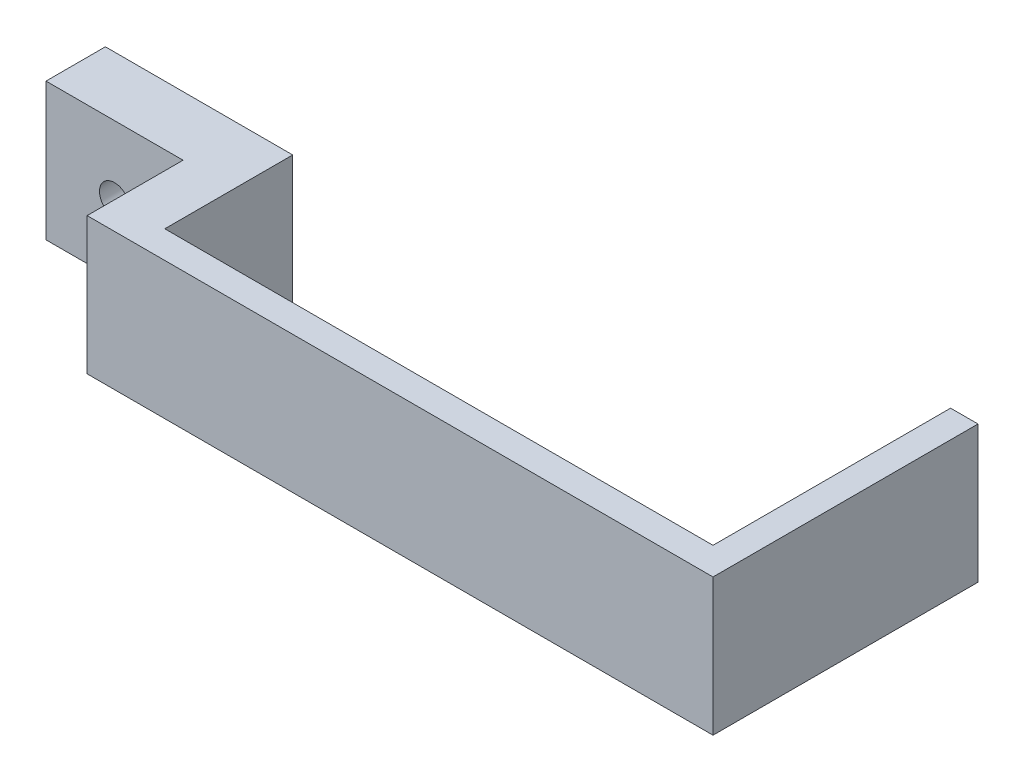
ISO-10303-21;
HEADER;
FILE_DESCRIPTION(('STEP AP214'),'2;1');
FILE_NAME('part.step','',(''),(''),'','','');
FILE_SCHEMA(('AUTOMOTIVE_DESIGN { 1 0 10303 214 1 1 1 1 }'));
ENDSEC;
DATA;
#1=APPLICATION_CONTEXT('core data for automotive mechanical design processes');
#2=APPLICATION_PROTOCOL_DEFINITION('international standard','automotive_design',2000,#1);
#3=PRODUCT_CONTEXT('',#1,'mechanical');
#4=PRODUCT('Part','Part','',(#3));
#5=PRODUCT_RELATED_PRODUCT_CATEGORY('part','',(#4));
#6=PRODUCT_DEFINITION_FORMATION('','',#4);
#7=PRODUCT_DEFINITION_CONTEXT('part definition',#1,'design');
#8=PRODUCT_DEFINITION('design','',#6,#7);
#9=PRODUCT_DEFINITION_SHAPE('','',#8);
#10=(LENGTH_UNIT() NAMED_UNIT(*) SI_UNIT(.MILLI.,.METRE.));
#11=(NAMED_UNIT(*) PLANE_ANGLE_UNIT() SI_UNIT($,.RADIAN.));
#12=(NAMED_UNIT(*) SI_UNIT($,.STERADIAN.) SOLID_ANGLE_UNIT());
#13=UNCERTAINTY_MEASURE_WITH_UNIT(LENGTH_MEASURE(1.E-05),#10,'distance_accuracy_value','');
#14=(GEOMETRIC_REPRESENTATION_CONTEXT(3) GLOBAL_UNCERTAINTY_ASSIGNED_CONTEXT((#13)) GLOBAL_UNIT_ASSIGNED_CONTEXT((#10,
#11,#12)) REPRESENTATION_CONTEXT('',''));
#15=CARTESIAN_POINT('',(0.,0.,0.));
#16=DIRECTION('',(0.,0.,1.));
#17=DIRECTION('',(1.,0.,0.));
#18=AXIS2_PLACEMENT_3D('',#15,#16,#17);
#19=CARTESIAN_POINT('',(0.,0.,0.));
#20=DIRECTION('',(0.,0.,-1.));
#21=DIRECTION('',(-1.,0.,0.));
#22=AXIS2_PLACEMENT_3D('',#19,#20,#21);
#23=PLANE('',#22);
#24=DIRECTION('',(-1.,0.,0.));
#25=VECTOR('',#24,1.);
#26=CARTESIAN_POINT('',(59.4999999999999,-52.5000000000001,0.));
#27=LINE('',#26,#25);
#28=CARTESIAN_POINT('',(60.4999999999999,-52.5000000000001,0.));
#29=VERTEX_POINT('',#28);
#30=CARTESIAN_POINT('',(-59.4999999999986,-52.5000000000001,0.));
#31=VERTEX_POINT('',#30);
#32=EDGE_CURVE('E197',#29,#31,#27,.T.);
#33=ORIENTED_EDGE('',*,*,#32,.F.);
#34=DIRECTION('',(0.,1.,0.));
#35=VECTOR('',#34,1.);
#36=CARTESIAN_POINT('',(60.4999999999999,-52.5000000000001,0.));
#37=LINE('',#36,#35);
#38=CARTESIAN_POINT('',(60.4999999999999,-82.5000000000001,0.));
#39=VERTEX_POINT('',#38);
#40=EDGE_CURVE('E139',#39,#29,#37,.T.);
#41=ORIENTED_EDGE('',*,*,#40,.F.);
#42=DIRECTION('',(1.,0.,0.));
#43=VECTOR('',#42,1.);
#44=CARTESIAN_POINT('',(59.4999999999999,-82.5000000000001,0.));
#45=LINE('',#44,#43);
#46=CARTESIAN_POINT('',(-59.4999999999986,-82.5000000000001,0.));
#47=VERTEX_POINT('',#46);
#48=EDGE_CURVE('E209',#47,#39,#45,.T.);
#49=ORIENTED_EDGE('',*,*,#48,.F.);
#50=DIRECTION('',(0.,-1.,0.));
#51=VECTOR('',#50,1.);
#52=CARTESIAN_POINT('',(-59.4999999999986,-52.5000000000001,0.));
#53=LINE('',#52,#51);
#54=EDGE_CURVE('E185',#31,#47,#53,.T.);
#55=ORIENTED_EDGE('',*,*,#54,.F.);
#56=EDGE_LOOP('',(#33,#41,#49,#55));
#57=FACE_BOUND('',#56,.T.);
#58=ADVANCED_FACE('F33',(#57),#23,.T.);
#59=CARTESIAN_POINT('',(-70.5000000000002,-82.5000000000001,6.));
#60=DIRECTION('',(1.,0.,0.));
#61=DIRECTION('',(0.,0.,-1.));
#62=AXIS2_PLACEMENT_3D('',#59,#60,#61);
#63=PLANE('',#62);
#64=DIRECTION('',(0.,1.,0.));
#65=VECTOR('',#64,1.);
#66=CARTESIAN_POINT('',(-70.5000000000002,-52.5000000000001,-14.9999999999993));
#67=LINE('',#66,#65);
#68=CARTESIAN_POINT('',(-70.5000000000002,-82.6,-14.9999999999993));
#69=VERTEX_POINT('',#68);
#70=CARTESIAN_POINT('',(-70.5000000000002,-52.5000000000001,-14.9999999999993));
#71=VERTEX_POINT('',#70);
#72=EDGE_CURVE('E57',#69,#71,#67,.T.);
#73=ORIENTED_EDGE('',*,*,#72,.F.);
#74=DIRECTION('',(0.,0.,1.));
#75=VECTOR('',#74,1.);
#76=CARTESIAN_POINT('',(-70.5000000000002,-82.6,-28.));
#77=LINE('',#76,#75);
#78=CARTESIAN_POINT('',(-70.5000000000002,-82.6,0.));
#79=VERTEX_POINT('',#78);
#80=EDGE_CURVE('E181',#69,#79,#77,.T.);
#81=ORIENTED_EDGE('',*,*,#80,.T.);
#82=DIRECTION('',(0.,1.,0.));
#83=VECTOR('',#82,1.);
#84=CARTESIAN_POINT('',(-70.5000000000002,-52.5000000000001,0.));
#85=LINE('',#84,#83);
#86=CARTESIAN_POINT('',(-70.5000000000002,-82.5000000000001,0.));
#87=VERTEX_POINT('',#86);
#88=EDGE_CURVE('E173',#79,#87,#85,.T.);
#89=ORIENTED_EDGE('',*,*,#88,.T.);
#90=DIRECTION('',(0.,0.,-1.));
#91=VECTOR('',#90,1.);
#92=CARTESIAN_POINT('',(-70.5000000000002,-82.5000000000001,6.));
#93=LINE('',#92,#91);
#94=CARTESIAN_POINT('',(-70.5000000000002,-82.5000000000001,6.));
#95=VERTEX_POINT('',#94);
#96=EDGE_CURVE('E207',#95,#87,#93,.T.);
#97=ORIENTED_EDGE('',*,*,#96,.F.);
#98=DIRECTION('',(0.,-1.,0.));
#99=VECTOR('',#98,1.);
#100=CARTESIAN_POINT('',(-70.5000000000002,-82.5000000000001,6.));
#101=LINE('',#100,#99);
#102=CARTESIAN_POINT('',(-70.5000000000002,-52.5000000000001,6.));
#103=VERTEX_POINT('',#102);
#104=EDGE_CURVE('E204',#103,#95,#101,.T.);
#105=ORIENTED_EDGE('',*,*,#104,.F.);
#106=DIRECTION('',(0.,0.,-1.));
#107=VECTOR('',#106,1.);
#108=CARTESIAN_POINT('',(-70.5000000000002,-52.5000000000001,6.));
#109=LINE('',#108,#107);
#110=EDGE_CURVE('E212',#103,#71,#109,.T.);
#111=ORIENTED_EDGE('',*,*,#110,.T.);
#112=EDGE_LOOP('',(#73,#81,#89,#97,#105,#111));
#113=FACE_BOUND('',#112,.T.);
#114=ADVANCED_FACE('F228',(#113),#63,.F.);
#115=CARTESIAN_POINT('',(66.4999999999999,-52.5000000000001,6.));
#116=DIRECTION('',(-1.,0.,0.));
#117=DIRECTION('',(0.,0.,1.));
#118=AXIS2_PLACEMENT_3D('',#115,#116,#117);
#119=PLANE('',#118);
#120=DIRECTION('',(0.,0.,-1.));
#121=VECTOR('',#120,1.);
#122=CARTESIAN_POINT('',(66.4999999999999,-82.5000000000001,6.));
#123=LINE('',#122,#121);
#124=CARTESIAN_POINT('',(66.4999999999999,-82.5000000000001,6.));
#125=VERTEX_POINT('',#124);
#126=CARTESIAN_POINT('',(66.4999999999999,-82.5000000000001,-51.9999999999996));
#127=VERTEX_POINT('',#126);
#128=EDGE_CURVE('E11',#125,#127,#123,.T.);
#129=ORIENTED_EDGE('',*,*,#128,.T.);
#130=DIRECTION('',(0.,-1.,0.));
#131=VECTOR('',#130,1.);
#132=CARTESIAN_POINT('',(66.4999999999999,-52.5000000000001,-51.9999999999996));
#133=LINE('',#132,#131);
#134=CARTESIAN_POINT('',(66.4999999999999,-52.5000000000001,-51.9999999999996));
#135=VERTEX_POINT('',#134);
#136=EDGE_CURVE('E123',#135,#127,#133,.T.);
#137=ORIENTED_EDGE('',*,*,#136,.F.);
#138=DIRECTION('',(0.,0.,-1.));
#139=VECTOR('',#138,1.);
#140=CARTESIAN_POINT('',(66.4999999999999,-52.5000000000001,6.));
#141=LINE('',#140,#139);
#142=CARTESIAN_POINT('',(66.4999999999999,-52.5000000000001,6.));
#143=VERTEX_POINT('',#142);
#144=EDGE_CURVE('E42',#143,#135,#141,.T.);
#145=ORIENTED_EDGE('',*,*,#144,.F.);
#146=DIRECTION('',(0.,1.,0.));
#147=VECTOR('',#146,1.);
#148=CARTESIAN_POINT('',(66.4999999999999,-52.5000000000001,6.));
#149=LINE('',#148,#147);
#150=EDGE_CURVE('E124',#125,#143,#149,.T.);
#151=ORIENTED_EDGE('',*,*,#150,.F.);
#152=EDGE_LOOP('',(#129,#137,#145,#151));
#153=FACE_BOUND('',#152,.T.);
#154=ADVANCED_FACE('F35',(#153),#119,.F.);
#155=CARTESIAN_POINT('',(59.4999999999999,-52.5000000000001,6.));
#156=DIRECTION('',(0.,-1.,0.));
#157=DIRECTION('',(1.,0.,0.));
#158=AXIS2_PLACEMENT_3D('',#155,#156,#157);
#159=PLANE('',#158);
#160=ORIENTED_EDGE('',*,*,#144,.T.);
#161=DIRECTION('',(1.,0.,0.));
#162=VECTOR('',#161,1.);
#163=CARTESIAN_POINT('',(66.4999999999999,-52.5000000000001,-51.9999999999996));
#164=LINE('',#163,#162);
#165=CARTESIAN_POINT('',(60.4999999999999,-52.5000000000001,-51.9999999999996));
#166=VERTEX_POINT('',#165);
#167=EDGE_CURVE('E138',#166,#135,#164,.T.);
#168=ORIENTED_EDGE('',*,*,#167,.F.);
#169=DIRECTION('',(0.,0.,1.));
#170=VECTOR('',#169,1.);
#171=CARTESIAN_POINT('',(60.4999999999999,-52.5000000000001,-51.9999999999996));
#172=LINE('',#171,#170);
#173=EDGE_CURVE('E49',#166,#29,#172,.T.);
#174=ORIENTED_EDGE('',*,*,#173,.T.);
#175=ORIENTED_EDGE('',*,*,#32,.T.);
#176=DIRECTION('',(0.,0.,1.));
#177=VECTOR('',#176,1.);
#178=CARTESIAN_POINT('',(-59.4999999999986,-52.5000000000001,-28.));
#179=LINE('',#178,#177);
#180=CARTESIAN_POINT('',(-59.4999999999986,-52.5000000000001,-28.));
#181=VERTEX_POINT('',#180);
#182=EDGE_CURVE('E194',#181,#31,#179,.T.);
#183=ORIENTED_EDGE('',*,*,#182,.F.);
#184=DIRECTION('',(1.,0.,0.));
#185=VECTOR('',#184,1.);
#186=CARTESIAN_POINT('',(-70.5000000000002,-52.5000000000001,-28.));
#187=LINE('',#186,#185);
#188=CARTESIAN_POINT('',(-100.5,-52.5000000000001,-28.));
#189=VERTEX_POINT('',#188);
#190=EDGE_CURVE('E174',#189,#181,#187,.T.);
#191=ORIENTED_EDGE('',*,*,#190,.F.);
#192=DIRECTION('',(0.,0.,-1.));
#193=VECTOR('',#192,1.);
#194=CARTESIAN_POINT('',(-100.5,-52.5000000000001,-28.));
#195=LINE('',#194,#193);
#196=CARTESIAN_POINT('',(-100.5,-52.5000000000001,-14.9999999999993));
#197=VERTEX_POINT('',#196);
#198=EDGE_CURVE('E163',#197,#189,#195,.T.);
#199=ORIENTED_EDGE('',*,*,#198,.F.);
#200=DIRECTION('',(1.,0.,0.));
#201=VECTOR('',#200,1.);
#202=CARTESIAN_POINT('',(-100.5,-52.5000000000001,-14.9999999999993));
#203=LINE('',#202,#201);
#204=EDGE_CURVE('E166',#197,#71,#203,.T.);
#205=ORIENTED_EDGE('',*,*,#204,.T.);
#206=ORIENTED_EDGE('',*,*,#110,.F.);
#207=DIRECTION('',(-1.,0.,0.));
#208=VECTOR('',#207,1.);
#209=CARTESIAN_POINT('',(59.4999999999999,-52.5000000000001,6.));
#210=LINE('',#209,#208);
#211=EDGE_CURVE('E202',#143,#103,#210,.T.);
#212=ORIENTED_EDGE('',*,*,#211,.F.);
#213=EDGE_LOOP('',(#160,#168,#174,#175,#183,#191,#199,#205,#206,#212));
#214=FACE_BOUND('',#213,.T.);
#215=ADVANCED_FACE('F215',(#214),#159,.F.);
#216=CARTESIAN_POINT('',(59.4999999999999,-82.5000000000001,6.));
#217=DIRECTION('',(0.,1.,0.));
#218=DIRECTION('',(-1.,0.,0.));
#219=AXIS2_PLACEMENT_3D('',#216,#217,#218);
#220=PLANE('',#219);
#221=EDGE_CURVE('E200',#87,#47,#45,.T.);
#222=ORIENTED_EDGE('',*,*,#221,.T.);
#223=ORIENTED_EDGE('',*,*,#48,.T.);
#224=DIRECTION('',(0.,0.,1.));
#225=VECTOR('',#224,1.);
#226=CARTESIAN_POINT('',(60.4999999999999,-82.5000000000001,-51.9999999999996));
#227=LINE('',#226,#225);
#228=CARTESIAN_POINT('',(60.4999999999999,-82.5000000000001,-51.9999999999996));
#229=VERTEX_POINT('',#228);
#230=EDGE_CURVE('E131',#229,#39,#227,.T.);
#231=ORIENTED_EDGE('',*,*,#230,.F.);
#232=DIRECTION('',(-1.,0.,0.));
#233=VECTOR('',#232,1.);
#234=CARTESIAN_POINT('',(66.4999999999999,-82.5000000000001,-51.9999999999996));
#235=LINE('',#234,#233);
#236=EDGE_CURVE('E128',#127,#229,#235,.T.);
#237=ORIENTED_EDGE('',*,*,#236,.F.);
#238=ORIENTED_EDGE('',*,*,#128,.F.);
#239=DIRECTION('',(1.,0.,0.));
#240=VECTOR('',#239,1.);
#241=CARTESIAN_POINT('',(59.4999999999999,-82.5000000000001,6.));
#242=LINE('',#241,#240);
#243=EDGE_CURVE('E198',#95,#125,#242,.T.);
#244=ORIENTED_EDGE('',*,*,#243,.F.);
#245=ORIENTED_EDGE('',*,*,#96,.T.);
#246=EDGE_LOOP('',(#222,#223,#231,#237,#238,#244,#245));
#247=FACE_BOUND('',#246,.T.);
#248=ADVANCED_FACE('F129',(#247),#220,.F.);
#249=CARTESIAN_POINT('',(0.,0.,6.));
#250=DIRECTION('',(0.,0.,-1.));
#251=DIRECTION('',(-1.,0.,0.));
#252=AXIS2_PLACEMENT_3D('',#249,#250,#251);
#253=PLANE('',#252);
#254=ORIENTED_EDGE('',*,*,#243,.T.);
#255=ORIENTED_EDGE('',*,*,#150,.T.);
#256=ORIENTED_EDGE('',*,*,#211,.T.);
#257=ORIENTED_EDGE('',*,*,#104,.T.);
#258=EDGE_LOOP('',(#254,#255,#256,#257));
#259=FACE_BOUND('',#258,.T.);
#260=ADVANCED_FACE('F219',(#259),#253,.F.);
#261=CARTESIAN_POINT('',(0.,0.,0.));
#262=DIRECTION('',(0.,0.,1.));
#263=DIRECTION('',(1.,0.,0.));
#264=AXIS2_PLACEMENT_3D('',#261,#262,#263);
#265=PLANE('',#264);
#266=ORIENTED_EDGE('',*,*,#221,.F.);
#267=ORIENTED_EDGE('',*,*,#88,.F.);
#268=DIRECTION('',(-1.,0.,0.));
#269=VECTOR('',#268,1.);
#270=CARTESIAN_POINT('',(-70.5000000000002,-82.6,0.));
#271=LINE('',#270,#269);
#272=CARTESIAN_POINT('',(-59.4999999999986,-82.6,0.));
#273=VERTEX_POINT('',#272);
#274=EDGE_CURVE('E177',#273,#79,#271,.T.);
#275=ORIENTED_EDGE('',*,*,#274,.F.);
#276=EDGE_CURVE('E184',#47,#273,#53,.T.);
#277=ORIENTED_EDGE('',*,*,#276,.F.);
#278=EDGE_LOOP('',(#266,#267,#275,#277));
#279=FACE_BOUND('',#278,.T.);
#280=ADVANCED_FACE('F226',(#279),#265,.T.);
#281=CARTESIAN_POINT('',(-59.4999999999986,-52.5000000000001,-28.));
#282=DIRECTION('',(-1.,0.,0.));
#283=DIRECTION('',(0.,0.,1.));
#284=AXIS2_PLACEMENT_3D('',#281,#282,#283);
#285=PLANE('',#284);
#286=ORIENTED_EDGE('',*,*,#54,.T.);
#287=ORIENTED_EDGE('',*,*,#276,.T.);
#288=DIRECTION('',(0.,0.,1.));
#289=VECTOR('',#288,1.);
#290=CARTESIAN_POINT('',(-59.4999999999986,-82.6,-28.));
#291=LINE('',#290,#289);
#292=CARTESIAN_POINT('',(-59.4999999999986,-82.6,-28.));
#293=VERTEX_POINT('',#292);
#294=EDGE_CURVE('E191',#293,#273,#291,.T.);
#295=ORIENTED_EDGE('',*,*,#294,.F.);
#296=DIRECTION('',(0.,-1.,0.));
#297=VECTOR('',#296,1.);
#298=CARTESIAN_POINT('',(-59.4999999999986,-52.5000000000001,-28.));
#299=LINE('',#298,#297);
#300=EDGE_CURVE('E176',#181,#293,#299,.T.);
#301=ORIENTED_EDGE('',*,*,#300,.F.);
#302=ORIENTED_EDGE('',*,*,#182,.T.);
#303=EDGE_LOOP('',(#286,#287,#295,#301,#302));
#304=FACE_BOUND('',#303,.T.);
#305=ADVANCED_FACE('F237',(#304),#285,.F.);
#306=CARTESIAN_POINT('',(-70.5000000000002,-82.6,-28.));
#307=DIRECTION('',(0.,1.,0.));
#308=DIRECTION('',(0.,0.,1.));
#309=AXIS2_PLACEMENT_3D('',#306,#307,#308);
#310=PLANE('',#309);
#311=ORIENTED_EDGE('',*,*,#274,.T.);
#312=ORIENTED_EDGE('',*,*,#80,.F.);
#313=DIRECTION('',(1.,0.,0.));
#314=VECTOR('',#313,1.);
#315=CARTESIAN_POINT('',(-100.5,-82.6,-14.9999999999993));
#316=LINE('',#315,#314);
#317=CARTESIAN_POINT('',(-100.5,-82.6,-14.9999999999993));
#318=VERTEX_POINT('',#317);
#319=EDGE_CURVE('E170',#318,#69,#316,.T.);
#320=ORIENTED_EDGE('',*,*,#319,.F.);
#321=DIRECTION('',(0.,0.,1.));
#322=VECTOR('',#321,1.);
#323=CARTESIAN_POINT('',(-100.5,-82.6,-28.));
#324=LINE('',#323,#322);
#325=CARTESIAN_POINT('',(-100.5,-82.6,-28.));
#326=VERTEX_POINT('',#325);
#327=EDGE_CURVE('E159',#326,#318,#324,.T.);
#328=ORIENTED_EDGE('',*,*,#327,.F.);
#329=DIRECTION('',(-1.,0.,0.));
#330=VECTOR('',#329,1.);
#331=CARTESIAN_POINT('',(-70.5000000000002,-82.6,-28.));
#332=LINE('',#331,#330);
#333=EDGE_CURVE('E179',#293,#326,#332,.T.);
#334=ORIENTED_EDGE('',*,*,#333,.F.);
#335=ORIENTED_EDGE('',*,*,#294,.T.);
#336=EDGE_LOOP('',(#311,#312,#320,#328,#334,#335));
#337=FACE_BOUND('',#336,.T.);
#338=ADVANCED_FACE('F231',(#337),#310,.F.);
#339=CARTESIAN_POINT('',(0.,0.,-28.));
#340=DIRECTION('',(0.,0.,1.));
#341=DIRECTION('',(1.,0.,0.));
#342=AXIS2_PLACEMENT_3D('',#339,#340,#341);
#343=PLANE('',#342);
#344=CARTESIAN_POINT('',(-85.4928919774176,-67.5500000000001,-28.));
#345=DIRECTION('',(0.,0.,-1.));
#346=DIRECTION('',(-1.,0.,0.));
#347=AXIS2_PLACEMENT_3D('',#344,#345,#346);
#348=CIRCLE('',#347,6.49999999999999);
#349=CARTESIAN_POINT('',(-91.9928919774176,-67.5500000000001,-28.));
#350=VERTEX_POINT('',#349);
#351=EDGE_CURVE('E147',#350,#350,#348,.T.);
#352=ORIENTED_EDGE('',*,*,#351,.F.);
#353=EDGE_LOOP('',(#352));
#354=FACE_BOUND('',#353,.T.);
#355=ORIENTED_EDGE('',*,*,#333,.T.);
#356=DIRECTION('',(0.,-1.,0.));
#357=VECTOR('',#356,1.);
#358=CARTESIAN_POINT('',(-100.5,-52.5000000000001,-28.));
#359=LINE('',#358,#357);
#360=EDGE_CURVE('E156',#189,#326,#359,.T.);
#361=ORIENTED_EDGE('',*,*,#360,.F.);
#362=ORIENTED_EDGE('',*,*,#190,.T.);
#363=ORIENTED_EDGE('',*,*,#300,.T.);
#364=EDGE_LOOP('',(#355,#361,#362,#363));
#365=FACE_BOUND('',#364,.T.);
#366=ADVANCED_FACE('F292',(#354,#365),#343,.F.);
#367=CARTESIAN_POINT('',(-100.5,-52.5000000000001,-14.9999999999993));
#368=DIRECTION('',(0.,0.,-1.));
#369=DIRECTION('',(-1.,0.,0.));
#370=AXIS2_PLACEMENT_3D('',#367,#368,#369);
#371=PLANE('',#370);
#372=CARTESIAN_POINT('',(-85.4928919774176,-67.5500000000001,-14.9999999999993));
#373=DIRECTION('',(0.,0.,-1.));
#374=DIRECTION('',(-1.,0.,0.));
#375=AXIS2_PLACEMENT_3D('',#372,#373,#374);
#376=CIRCLE('',#375,3.3);
#377=CARTESIAN_POINT('',(-88.7928919774176,-67.5500000000001,-14.9999999999993));
#378=VERTEX_POINT('',#377);
#379=EDGE_CURVE('E37',#378,#378,#376,.T.);
#380=ORIENTED_EDGE('',*,*,#379,.T.);
#381=EDGE_LOOP('',(#380));
#382=FACE_BOUND('',#381,.T.);
#383=ORIENTED_EDGE('',*,*,#72,.T.);
#384=ORIENTED_EDGE('',*,*,#204,.F.);
#385=DIRECTION('',(0.,1.,0.));
#386=VECTOR('',#385,1.);
#387=CARTESIAN_POINT('',(-100.5,-52.5000000000001,-14.9999999999993));
#388=LINE('',#387,#386);
#389=EDGE_CURVE('E161',#318,#197,#388,.T.);
#390=ORIENTED_EDGE('',*,*,#389,.F.);
#391=ORIENTED_EDGE('',*,*,#319,.T.);
#392=EDGE_LOOP('',(#383,#384,#390,#391));
#393=FACE_BOUND('',#392,.T.);
#394=ADVANCED_FACE('F306',(#382,#393),#371,.F.);
#395=CARTESIAN_POINT('',(-100.5,0.,0.));
#396=DIRECTION('',(-1.,0.,0.));
#397=DIRECTION('',(0.,0.,1.));
#398=AXIS2_PLACEMENT_3D('',#395,#396,#397);
#399=PLANE('',#398);
#400=ORIENTED_EDGE('',*,*,#360,.T.);
#401=ORIENTED_EDGE('',*,*,#327,.T.);
#402=ORIENTED_EDGE('',*,*,#389,.T.);
#403=ORIENTED_EDGE('',*,*,#198,.T.);
#404=EDGE_LOOP('',(#400,#401,#402,#403));
#405=FACE_BOUND('',#404,.T.);
#406=ADVANCED_FACE('F300',(#405),#399,.T.);
#407=CARTESIAN_POINT('',(-85.4928919774176,-67.5500000000001,-28.));
#408=DIRECTION('',(0.,0.,-1.));
#409=DIRECTION('',(-1.,0.,0.));
#410=AXIS2_PLACEMENT_3D('',#407,#408,#409);
#411=CYLINDRICAL_SURFACE('',#410,3.3);
#412=CARTESIAN_POINT('',(-85.4928919774176,-67.5500000000001,-23.4));
#413=DIRECTION('',(0.,0.,-1.));
#414=DIRECTION('',(-1.,0.,0.));
#415=AXIS2_PLACEMENT_3D('',#412,#413,#414);
#416=CIRCLE('',#415,3.3);
#417=CARTESIAN_POINT('',(-88.7928919774176,-67.5500000000001,-23.4));
#418=VERTEX_POINT('',#417);
#419=EDGE_CURVE('E153',#418,#418,#416,.T.);
#420=ORIENTED_EDGE('',*,*,#419,.T.);
#421=EDGE_LOOP('',(#420));
#422=FACE_BOUND('',#421,.T.);
#423=ORIENTED_EDGE('',*,*,#379,.F.);
#424=EDGE_LOOP('',(#423));
#425=FACE_BOUND('',#424,.T.);
#426=ADVANCED_FACE('F305',(#422,#425),#411,.F.);
#427=CARTESIAN_POINT('',(-82.1928919774176,-67.5500000000001,-23.4));
#428=DIRECTION('',(0.,0.,1.));
#429=DIRECTION('',(1.,0.,0.));
#430=AXIS2_PLACEMENT_3D('',#427,#428,#429);
#431=PLANE('',#430);
#432=ORIENTED_EDGE('',*,*,#419,.F.);
#433=EDGE_LOOP('',(#432));
#434=FACE_BOUND('',#433,.T.);
#435=CARTESIAN_POINT('',(-85.4928919774176,-67.5500000000001,-23.4));
#436=DIRECTION('',(0.,0.,-1.));
#437=DIRECTION('',(-1.,0.,0.));
#438=AXIS2_PLACEMENT_3D('',#435,#436,#437);
#439=CIRCLE('',#438,6.49999999999999);
#440=CARTESIAN_POINT('',(-91.9928919774176,-67.5500000000001,-23.4));
#441=VERTEX_POINT('',#440);
#442=EDGE_CURVE('E150',#441,#441,#439,.T.);
#443=ORIENTED_EDGE('',*,*,#442,.T.);
#444=EDGE_LOOP('',(#443));
#445=FACE_BOUND('',#444,.T.);
#446=ADVANCED_FACE('F253',(#434,#445),#431,.F.);
#447=CARTESIAN_POINT('',(-85.4928919774176,-67.5500000000001,-28.));
#448=DIRECTION('',(0.,0.,-1.));
#449=DIRECTION('',(-1.,0.,0.));
#450=AXIS2_PLACEMENT_3D('',#447,#448,#449);
#451=CYLINDRICAL_SURFACE('',#450,6.49999999999999);
#452=ORIENTED_EDGE('',*,*,#442,.F.);
#453=EDGE_LOOP('',(#452));
#454=FACE_BOUND('',#453,.T.);
#455=ORIENTED_EDGE('',*,*,#351,.T.);
#456=EDGE_LOOP('',(#455));
#457=FACE_BOUND('',#456,.T.);
#458=ADVANCED_FACE('F246',(#454,#457),#451,.F.);
#459=CARTESIAN_POINT('',(60.4999999999999,-52.5000000000001,-51.9999999999996));
#460=DIRECTION('',(1.,0.,0.));
#461=DIRECTION('',(0.,0.,-1.));
#462=AXIS2_PLACEMENT_3D('',#459,#460,#461);
#463=PLANE('',#462);
#464=ORIENTED_EDGE('',*,*,#40,.T.);
#465=ORIENTED_EDGE('',*,*,#173,.F.);
#466=DIRECTION('',(0.,1.,0.));
#467=VECTOR('',#466,1.);
#468=CARTESIAN_POINT('',(60.4999999999999,-52.5000000000001,-51.9999999999996));
#469=LINE('',#468,#467);
#470=EDGE_CURVE('E134',#229,#166,#469,.T.);
#471=ORIENTED_EDGE('',*,*,#470,.F.);
#472=ORIENTED_EDGE('',*,*,#230,.T.);
#473=EDGE_LOOP('',(#464,#465,#471,#472));
#474=FACE_BOUND('',#473,.T.);
#475=ADVANCED_FACE('F244',(#474),#463,.F.);
#476=CARTESIAN_POINT('',(0.,0.,-51.9999999999996));
#477=DIRECTION('',(0.,0.,-1.));
#478=DIRECTION('',(-1.,0.,0.));
#479=AXIS2_PLACEMENT_3D('',#476,#477,#478);
#480=PLANE('',#479);
#481=ORIENTED_EDGE('',*,*,#136,.T.);
#482=ORIENTED_EDGE('',*,*,#236,.T.);
#483=ORIENTED_EDGE('',*,*,#470,.T.);
#484=ORIENTED_EDGE('',*,*,#167,.T.);
#485=EDGE_LOOP('',(#481,#482,#483,#484));
#486=FACE_BOUND('',#485,.T.);
#487=ADVANCED_FACE('F137',(#486),#480,.T.);
#488=CLOSED_SHELL('',(#58,#114,#154,#215,#248,#260,#280,#305,#338,#366,#394,#406,#426,#446,#458,
#475,#487));
#489=MANIFOLD_SOLID_BREP('B2',#488);
#490=ADVANCED_BREP_SHAPE_REPRESENTATION('',(#18,#489),#14);
#491=SHAPE_DEFINITION_REPRESENTATION(#9,#490);
ENDSEC;
END-ISO-10303-21;
